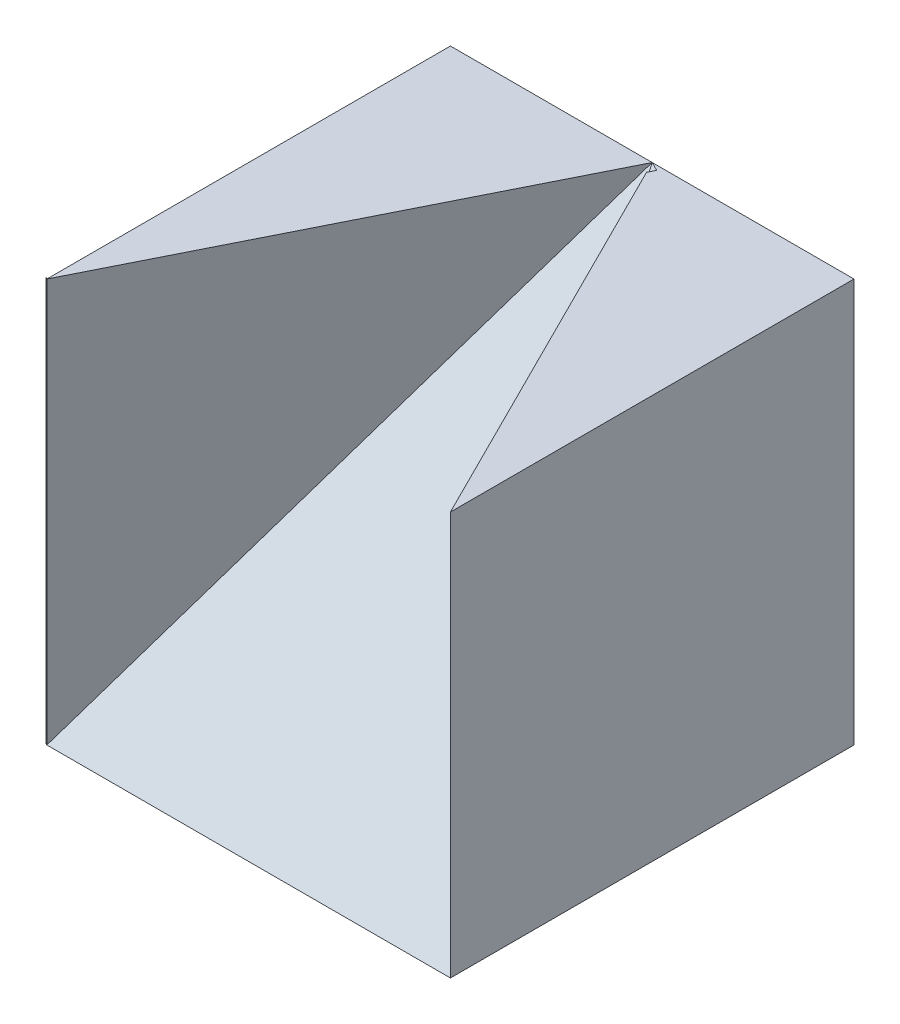
ISO-10303-21;
HEADER;
FILE_DESCRIPTION(('STEP AP214'),'2;1');
FILE_NAME('part.step','',(''),(''),'','','');
FILE_SCHEMA(('AUTOMOTIVE_DESIGN { 1 0 10303 214 1 1 1 1 }'));
ENDSEC;
DATA;
#1=APPLICATION_CONTEXT('core data for automotive mechanical design processes');
#2=APPLICATION_PROTOCOL_DEFINITION('international standard','automotive_design',2000,#1);
#3=PRODUCT_CONTEXT('',#1,'mechanical');
#4=PRODUCT('Part','Part','',(#3));
#5=PRODUCT_RELATED_PRODUCT_CATEGORY('part','',(#4));
#6=PRODUCT_DEFINITION_FORMATION('','',#4);
#7=PRODUCT_DEFINITION_CONTEXT('part definition',#1,'design');
#8=PRODUCT_DEFINITION('design','',#6,#7);
#9=PRODUCT_DEFINITION_SHAPE('','',#8);
#10=(LENGTH_UNIT() NAMED_UNIT(*) SI_UNIT(.MILLI.,.METRE.));
#11=(NAMED_UNIT(*) PLANE_ANGLE_UNIT() SI_UNIT($,.RADIAN.));
#12=(NAMED_UNIT(*) SI_UNIT($,.STERADIAN.) SOLID_ANGLE_UNIT());
#13=UNCERTAINTY_MEASURE_WITH_UNIT(LENGTH_MEASURE(1.E-05),#10,'distance_accuracy_value','');
#14=(GEOMETRIC_REPRESENTATION_CONTEXT(3) GLOBAL_UNCERTAINTY_ASSIGNED_CONTEXT((#13)) GLOBAL_UNIT_ASSIGNED_CONTEXT((#10,
#11,#12)) REPRESENTATION_CONTEXT('',''));
#15=CARTESIAN_POINT('',(0.,0.,0.));
#16=DIRECTION('',(0.,0.,1.));
#17=DIRECTION('',(1.,0.,0.));
#18=AXIS2_PLACEMENT_3D('',#15,#16,#17);
#19=CARTESIAN_POINT('',(-14.3662180771089,17.7777777777778,10.5946687392233));
#20=DIRECTION('',(0.298142396999972,-0.74535599249993,-0.596284793999944));
#21=DIRECTION('',(0.,0.624695047554424,-0.78086880944303));
#22=AXIS2_PLACEMENT_3D('',#19,#20,#21);
#23=PLANE('',#22);
#24=DIRECTION('',(0.894427190999916,0.,0.447213595499958));
#25=VECTOR('',#24,1.);
#26=CARTESIAN_POINT('',(-23.2551069659978,0.,28.3724465170011));
#27=LINE('',#26,#25);
#28=CARTESIAN_POINT('',(-0.167294502107354,0.,39.9163527489463));
#29=VERTEX_POINT('',#28);
#30=CARTESIAN_POINT('',(0.,0.,40.));
#31=VERTEX_POINT('',#30);
#32=EDGE_CURVE('E55',#29,#31,#27,.T.);
#33=ORIENTED_EDGE('',*,*,#32,.F.);
#34=DIRECTION('',(0.928476690885259,0.371390676354104,0.));
#35=VECTOR('',#34,1.);
#36=CARTESIAN_POINT('',(-6.27747766063361,-2.4440732634105,39.9163527489463));
#37=LINE('',#36,#35);
#38=CARTESIAN_POINT('',(0.,0.0669178008429305,39.9163527489463));
#39=VERTEX_POINT('',#38);
#40=EDGE_CURVE('E49',#29,#39,#37,.T.);
#41=ORIENTED_EDGE('',*,*,#40,.T.);
#42=DIRECTION('',(0.,0.624695047554424,-0.78086880944303));
#43=VECTOR('',#42,1.);
#44=CARTESIAN_POINT('',(0.,0.,40.));
#45=LINE('',#44,#43);
#46=EDGE_CURVE('E108',#31,#39,#45,.T.);
#47=ORIENTED_EDGE('',*,*,#46,.F.);
#48=EDGE_LOOP('',(#33,#41,#47));
#49=FACE_BOUND('',#48,.T.);
#50=ADVANCED_FACE('F35',(#49),#23,.T.);
#51=CARTESIAN_POINT('',(0.,40.,40.));
#52=DIRECTION('',(0.,-1.,0.));
#53=DIRECTION('',(0.,0.,-1.));
#54=AXIS2_PLACEMENT_3D('',#51,#52,#53);
#55=PLANE('',#54);
#56=DIRECTION('',(1.,0.,0.));
#57=VECTOR('',#56,1.);
#58=CARTESIAN_POINT('',(0.,40.,39.9163527489463));
#59=LINE('',#58,#57);
#60=CARTESIAN_POINT('',(-0.167294502107378,40.,39.9163527489463));
#61=VERTEX_POINT('',#60);
#62=CARTESIAN_POINT('',(0.,40.,39.9163527489463));
#63=VERTEX_POINT('',#62);
#64=EDGE_CURVE('E100',#61,#63,#59,.T.);
#65=ORIENTED_EDGE('',*,*,#64,.F.);
#66=DIRECTION('',(0.894427190999916,0.,0.447213595499958));
#67=VECTOR('',#66,1.);
#68=CARTESIAN_POINT('',(-23.2551069659978,40.,28.3724465170011));
#69=LINE('',#68,#67);
#70=CARTESIAN_POINT('',(0.,40.,40.));
#71=VERTEX_POINT('',#70);
#72=EDGE_CURVE('E42',#61,#71,#69,.T.);
#73=ORIENTED_EDGE('',*,*,#72,.T.);
#74=DIRECTION('',(-0.447213595499958,0.,0.894427190999916));
#75=VECTOR('',#74,1.);
#76=CARTESIAN_POINT('',(16.,40.,7.99999999999997));
#77=LINE('',#76,#75);
#78=CARTESIAN_POINT('',(20.,40.,0.));
#79=VERTEX_POINT('',#78);
#80=EDGE_CURVE('E128',#79,#71,#77,.T.);
#81=ORIENTED_EDGE('',*,*,#80,.F.);
#82=DIRECTION('',(1.,0.,0.));
#83=VECTOR('',#82,1.);
#84=CARTESIAN_POINT('',(40.,40.,0.));
#85=LINE('',#84,#83);
#86=CARTESIAN_POINT('',(0.,40.,0.));
#87=VERTEX_POINT('',#86);
#88=EDGE_CURVE('E120',#87,#79,#85,.T.);
#89=ORIENTED_EDGE('',*,*,#88,.F.);
#90=DIRECTION('',(0.,0.,1.));
#91=VECTOR('',#90,1.);
#92=CARTESIAN_POINT('',(0.,40.,40.));
#93=LINE('',#92,#91);
#94=EDGE_CURVE('E109',#87,#63,#93,.T.);
#95=ORIENTED_EDGE('',*,*,#94,.T.);
#96=EDGE_LOOP('',(#65,#73,#81,#89,#95));
#97=FACE_BOUND('',#96,.T.);
#98=ADVANCED_FACE('F192',(#97),#55,.F.);
#99=CARTESIAN_POINT('',(-23.2551069659978,0.,28.3724465170011));
#100=DIRECTION('',(-0.447213595499958,0.,0.894427190999916));
#101=DIRECTION('',(0.894427190999916,0.,0.447213595499958));
#102=AXIS2_PLACEMENT_3D('',#99,#100,#101);
#103=PLANE('',#102);
#104=ORIENTED_EDGE('',*,*,#72,.F.);
#105=DIRECTION('',(0.,-1.,0.));
#106=VECTOR('',#105,1.);
#107=CARTESIAN_POINT('',(-0.167294502107344,0.,39.9163527489463));
#108=LINE('',#107,#106);
#109=EDGE_CURVE('E11',#61,#29,#108,.T.);
#110=ORIENTED_EDGE('',*,*,#109,.T.);
#111=ORIENTED_EDGE('',*,*,#32,.T.);
#112=DIRECTION('',(0.,-1.,0.));
#113=VECTOR('',#112,1.);
#114=CARTESIAN_POINT('',(0.,0.,40.));
#115=LINE('',#114,#113);
#116=EDGE_CURVE('E116',#71,#31,#115,.T.);
#117=ORIENTED_EDGE('',*,*,#116,.F.);
#118=EDGE_LOOP('',(#104,#110,#111,#117));
#119=FACE_BOUND('',#118,.T.);
#120=ADVANCED_FACE('F216',(#119),#103,.T.);
#121=CARTESIAN_POINT('',(16.,0.,8.00000000000001));
#122=DIRECTION('',(-0.894427190999916,0.,-0.447213595499958));
#123=DIRECTION('',(-0.447213595499958,0.,0.894427190999916));
#124=AXIS2_PLACEMENT_3D('',#121,#122,#123);
#125=PLANE('',#124);
#126=ORIENTED_EDGE('',*,*,#116,.T.);
#127=DIRECTION('',(0.333333333333333,0.666666666666667,-0.666666666666667));
#128=VECTOR('',#127,1.);
#129=CARTESIAN_POINT('',(8.88888888888889,17.7777777777778,22.2222222222222));
#130=LINE('',#129,#128);
#131=EDGE_CURVE('E131',#31,#79,#130,.T.);
#132=ORIENTED_EDGE('',*,*,#131,.T.);
#133=ORIENTED_EDGE('',*,*,#80,.T.);
#134=EDGE_LOOP('',(#126,#132,#133));
#135=FACE_BOUND('',#134,.T.);
#136=ADVANCED_FACE('F221',(#135),#125,.F.);
#137=CARTESIAN_POINT('',(0.,0.,40.));
#138=DIRECTION('',(1.,0.,0.));
#139=DIRECTION('',(0.,0.,-1.));
#140=AXIS2_PLACEMENT_3D('',#137,#138,#139);
#141=PLANE('',#140);
#142=DIRECTION('',(0.,-1.,0.));
#143=VECTOR('',#142,1.);
#144=CARTESIAN_POINT('',(0.,0.,0.));
#145=LINE('',#144,#143);
#146=CARTESIAN_POINT('',(0.,0.,0.));
#147=VERTEX_POINT('',#146);
#148=EDGE_CURVE('E115',#87,#147,#145,.T.);
#149=ORIENTED_EDGE('',*,*,#148,.T.);
#150=DIRECTION('',(0.,0.,-1.));
#151=VECTOR('',#150,1.);
#152=CARTESIAN_POINT('',(0.,0.,40.));
#153=LINE('',#152,#151);
#154=EDGE_CURVE('E114',#31,#147,#153,.T.);
#155=ORIENTED_EDGE('',*,*,#154,.F.);
#156=ORIENTED_EDGE('',*,*,#46,.T.);
#157=DIRECTION('',(0.,1.,0.));
#158=VECTOR('',#157,1.);
#159=CARTESIAN_POINT('',(0.,0.,39.9163527489463));
#160=LINE('',#159,#158);
#161=EDGE_CURVE('E97',#39,#63,#160,.T.);
#162=ORIENTED_EDGE('',*,*,#161,.T.);
#163=ORIENTED_EDGE('',*,*,#94,.F.);
#164=EDGE_LOOP('',(#149,#155,#156,#162,#163));
#165=FACE_BOUND('',#164,.T.);
#166=ADVANCED_FACE('F113',(#165),#141,.F.);
#167=DIRECTION('',(-1.,0.,0.));
#168=VECTOR('',#167,1.);
#169=CARTESIAN_POINT('',(0.,40.,0.));
#170=LINE('',#169,#168);
#171=CARTESIAN_POINT('',(40.,40.,0.));
#172=VERTEX_POINT('',#171);
#173=EDGE_CURVE('E118',#172,#79,#170,.T.);
#174=ORIENTED_EDGE('',*,*,#173,.T.);
#175=DIRECTION('',(-0.894427190999916,0.,-0.447213595499958));
#176=VECTOR('',#175,1.);
#177=CARTESIAN_POINT('',(20.8944271909999,40.,0.447213595499966));
#178=LINE('',#177,#176);
#179=CARTESIAN_POINT('',(20.8944271909999,40.,0.447213595499966));
#180=VERTEX_POINT('',#179);
#181=EDGE_CURVE('E130',#180,#79,#178,.T.);
#182=ORIENTED_EDGE('',*,*,#181,.F.);
#183=DIRECTION('',(0.447213595499958,0.,-0.894427190999916));
#184=VECTOR('',#183,1.);
#185=CARTESIAN_POINT('',(0.894427190999917,40.,40.4472135955));
#186=LINE('',#185,#184);
#187=CARTESIAN_POINT('',(20.559016994375,40.,1.11803398874991));
#188=VERTEX_POINT('',#187);
#189=EDGE_CURVE('E136',#188,#180,#186,.T.);
#190=ORIENTED_EDGE('',*,*,#189,.F.);
#191=DIRECTION('',(-0.447213595499958,0.,-0.894427190999916));
#192=VECTOR('',#191,1.);
#193=CARTESIAN_POINT('',(20.,40.,0.));
#194=LINE('',#193,#192);
#195=CARTESIAN_POINT('',(40.,40.,40.));
#196=VERTEX_POINT('',#195);
#197=EDGE_CURVE('E137',#196,#188,#194,.T.);
#198=ORIENTED_EDGE('',*,*,#197,.F.);
#199=DIRECTION('',(0.,0.,-1.));
#200=VECTOR('',#199,1.);
#201=CARTESIAN_POINT('',(40.,40.,40.));
#202=LINE('',#201,#200);
#203=EDGE_CURVE('E170',#196,#172,#202,.T.);
#204=ORIENTED_EDGE('',*,*,#203,.T.);
#205=EDGE_LOOP('',(#174,#182,#190,#198,#204));
#206=FACE_BOUND('',#205,.T.);
#207=ADVANCED_FACE('F169',(#206),#55,.F.);
#208=CARTESIAN_POINT('',(0.,0.,40.));
#209=DIRECTION('',(0.,1.,0.));
#210=DIRECTION('',(0.,0.,1.));
#211=AXIS2_PLACEMENT_3D('',#208,#209,#210);
#212=PLANE('',#211);
#213=DIRECTION('',(1.,0.,0.));
#214=VECTOR('',#213,1.);
#215=CARTESIAN_POINT('',(0.,0.,0.));
#216=LINE('',#215,#214);
#217=CARTESIAN_POINT('',(40.,0.,0.));
#218=VERTEX_POINT('',#217);
#219=EDGE_CURVE('E177',#147,#218,#216,.T.);
#220=ORIENTED_EDGE('',*,*,#219,.T.);
#221=DIRECTION('',(0.,0.,-1.));
#222=VECTOR('',#221,1.);
#223=CARTESIAN_POINT('',(40.,0.,40.));
#224=LINE('',#223,#222);
#225=CARTESIAN_POINT('',(40.,0.,40.));
#226=VERTEX_POINT('',#225);
#227=EDGE_CURVE('E182',#226,#218,#224,.T.);
#228=ORIENTED_EDGE('',*,*,#227,.F.);
#229=DIRECTION('',(1.,0.,0.));
#230=VECTOR('',#229,1.);
#231=CARTESIAN_POINT('',(0.,0.,40.));
#232=LINE('',#231,#230);
#233=EDGE_CURVE('E145',#31,#226,#232,.T.);
#234=ORIENTED_EDGE('',*,*,#233,.F.);
#235=ORIENTED_EDGE('',*,*,#154,.T.);
#236=EDGE_LOOP('',(#220,#228,#234,#235));
#237=FACE_BOUND('',#236,.T.);
#238=ADVANCED_FACE('F198',(#237),#212,.F.);
#239=CARTESIAN_POINT('',(40.,0.,40.));
#240=DIRECTION('',(-1.,0.,0.));
#241=DIRECTION('',(0.,0.,1.));
#242=AXIS2_PLACEMENT_3D('',#239,#240,#241);
#243=PLANE('',#242);
#244=DIRECTION('',(0.,1.,0.));
#245=VECTOR('',#244,1.);
#246=CARTESIAN_POINT('',(40.,0.,0.));
#247=LINE('',#246,#245);
#248=EDGE_CURVE('E176',#218,#172,#247,.T.);
#249=ORIENTED_EDGE('',*,*,#248,.T.);
#250=ORIENTED_EDGE('',*,*,#203,.F.);
#251=DIRECTION('',(0.,1.,0.));
#252=VECTOR('',#251,1.);
#253=CARTESIAN_POINT('',(40.,0.,40.));
#254=LINE('',#253,#252);
#255=EDGE_CURVE('E141',#226,#196,#254,.T.);
#256=ORIENTED_EDGE('',*,*,#255,.F.);
#257=ORIENTED_EDGE('',*,*,#227,.T.);
#258=EDGE_LOOP('',(#249,#250,#256,#257));
#259=FACE_BOUND('',#258,.T.);
#260=ADVANCED_FACE('F173',(#259),#243,.F.);
#261=CARTESIAN_POINT('',(0.,0.,0.));
#262=DIRECTION('',(0.,0.,-1.));
#263=DIRECTION('',(-1.,0.,0.));
#264=AXIS2_PLACEMENT_3D('',#261,#262,#263);
#265=PLANE('',#264);
#266=ORIENTED_EDGE('',*,*,#148,.F.);
#267=ORIENTED_EDGE('',*,*,#88,.T.);
#268=ORIENTED_EDGE('',*,*,#173,.F.);
#269=ORIENTED_EDGE('',*,*,#248,.F.);
#270=ORIENTED_EDGE('',*,*,#219,.F.);
#271=EDGE_LOOP('',(#266,#267,#268,#269,#270));
#272=FACE_BOUND('',#271,.T.);
#273=ADVANCED_FACE('F196',(#272),#265,.T.);
#274=CARTESIAN_POINT('',(0.,20.,20.));
#275=DIRECTION('',(0.,0.707106781186548,0.707106781186547));
#276=DIRECTION('',(0.,-0.707106781186547,0.707106781186548));
#277=AXIS2_PLACEMENT_3D('',#274,#275,#276);
#278=PLANE('',#277);
#279=ORIENTED_EDGE('',*,*,#233,.T.);
#280=DIRECTION('',(0.333333333333333,-0.666666666666667,0.666666666666667));
#281=VECTOR('',#280,1.);
#282=CARTESIAN_POINT('',(26.6666666666667,26.6666666666667,13.3333333333333));
#283=LINE('',#282,#281);
#284=EDGE_CURVE('E147',#79,#226,#283,.T.);
#285=ORIENTED_EDGE('',*,*,#284,.F.);
#286=ORIENTED_EDGE('',*,*,#131,.F.);
#287=EDGE_LOOP('',(#279,#285,#286));
#288=FACE_BOUND('',#287,.T.);
#289=ADVANCED_FACE('F202',(#288),#278,.T.);
#290=CARTESIAN_POINT('',(16.,0.,-7.99999999999999));
#291=DIRECTION('',(0.894427190999916,0.,-0.447213595499958));
#292=DIRECTION('',(-0.447213595499958,0.,-0.894427190999916));
#293=AXIS2_PLACEMENT_3D('',#290,#291,#292);
#294=PLANE('',#293);
#295=DIRECTION('',(0.,1.,0.));
#296=VECTOR('',#295,1.);
#297=CARTESIAN_POINT('',(20.5590169943749,0.,1.11803398874991));
#298=LINE('',#297,#296);
#299=CARTESIAN_POINT('',(20.559016994375,39.3291796067501,1.11803398874991));
#300=VERTEX_POINT('',#299);
#301=EDGE_CURVE('E127',#300,#188,#298,.T.);
#302=ORIENTED_EDGE('',*,*,#301,.F.);
#303=DIRECTION('',(-0.39405520311955,0.47286624374346,-0.788110406239101));
#304=VECTOR('',#303,1.);
#305=CARTESIAN_POINT('',(24.3478260869565,34.7826086956522,8.69565217391305));
#306=LINE('',#305,#304);
#307=EDGE_CURVE('E148',#300,#79,#306,.T.);
#308=ORIENTED_EDGE('',*,*,#307,.T.);
#309=ORIENTED_EDGE('',*,*,#284,.T.);
#310=ORIENTED_EDGE('',*,*,#255,.T.);
#311=ORIENTED_EDGE('',*,*,#197,.T.);
#312=EDGE_LOOP('',(#302,#308,#309,#310,#311));
#313=FACE_BOUND('',#312,.T.);
#314=ADVANCED_FACE('F162',(#313),#294,.F.);
#315=CARTESIAN_POINT('',(0.894427190999906,0.,40.4472135955));
#316=DIRECTION('',(0.298142396999972,-0.74535599249993,-0.596284793999944));
#317=DIRECTION('',(0.,0.624695047554424,-0.78086880944303));
#318=AXIS2_PLACEMENT_3D('',#315,#316,#317);
#319=PLANE('',#318);
#320=DIRECTION('',(-0.333333333333334,-0.666666666666667,0.666666666666667));
#321=VECTOR('',#320,1.);
#322=CARTESIAN_POINT('',(0.894427190999906,0.,40.4472135955));
#323=LINE('',#322,#321);
#324=EDGE_CURVE('E123',#180,#300,#323,.T.);
#325=ORIENTED_EDGE('',*,*,#324,.F.);
#326=ORIENTED_EDGE('',*,*,#181,.T.);
#327=ORIENTED_EDGE('',*,*,#307,.F.);
#328=EDGE_LOOP('',(#325,#326,#327));
#329=FACE_BOUND('',#328,.T.);
#330=ADVANCED_FACE('F209',(#329),#319,.F.);
#331=CARTESIAN_POINT('',(16.8944271909999,0.,8.44721359549996));
#332=DIRECTION('',(-0.894427190999916,0.,-0.447213595499958));
#333=DIRECTION('',(-0.447213595499958,0.,0.894427190999916));
#334=AXIS2_PLACEMENT_3D('',#331,#332,#333);
#335=PLANE('',#334);
#336=ORIENTED_EDGE('',*,*,#189,.T.);
#337=ORIENTED_EDGE('',*,*,#324,.T.);
#338=ORIENTED_EDGE('',*,*,#301,.T.);
#339=EDGE_LOOP('',(#336,#337,#338));
#340=FACE_BOUND('',#339,.T.);
#341=ADVANCED_FACE('F158',(#340),#335,.T.);
#342=CARTESIAN_POINT('',(-50.,0.,39.9163527489463));
#343=DIRECTION('',(0.,0.,-1.));
#344=DIRECTION('',(-1.,0.,0.));
#345=AXIS2_PLACEMENT_3D('',#342,#343,#344);
#346=PLANE('',#345);
#347=ORIENTED_EDGE('',*,*,#109,.F.);
#348=ORIENTED_EDGE('',*,*,#64,.T.);
#349=ORIENTED_EDGE('',*,*,#161,.F.);
#350=ORIENTED_EDGE('',*,*,#40,.F.);
#351=EDGE_LOOP('',(#347,#348,#349,#350));
#352=FACE_BOUND('',#351,.T.);
#353=ADVANCED_FACE('F98',(#352),#346,.T.);
#354=CLOSED_SHELL('',(#50,#98,#120,#136,#166,#207,#238,#260,#273,#289,#314,#330,#341,#353));
#355=MANIFOLD_SOLID_BREP('B2',#354);
#356=ADVANCED_BREP_SHAPE_REPRESENTATION('',(#18,#355),#14);
#357=SHAPE_DEFINITION_REPRESENTATION(#9,#356);
ENDSEC;
END-ISO-10303-21;
